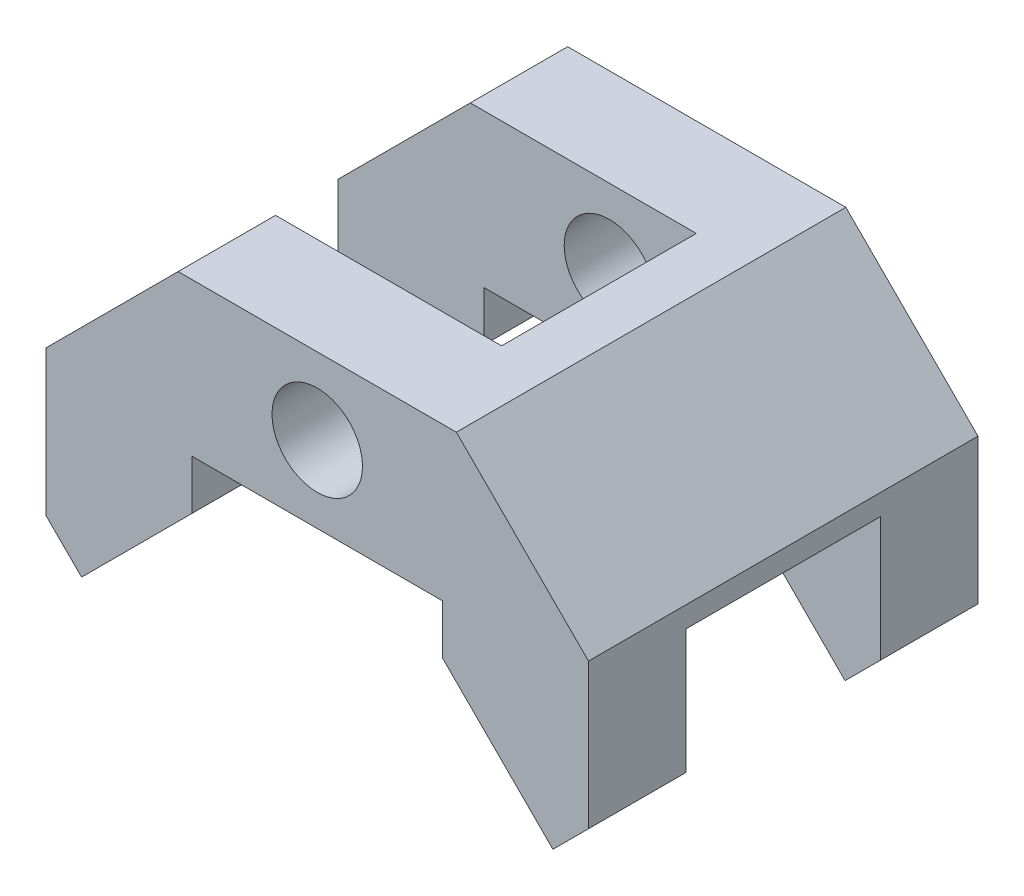
ISO-10303-21;
HEADER;
FILE_DESCRIPTION(('STEP AP214'),'2;1');
FILE_NAME('part.step','',(''),(''),'','','');
FILE_SCHEMA(('AUTOMOTIVE_DESIGN { 1 0 10303 214 1 1 1 1 }'));
ENDSEC;
DATA;
#1=APPLICATION_CONTEXT('core data for automotive mechanical design processes');
#2=APPLICATION_PROTOCOL_DEFINITION('international standard','automotive_design',2000,#1);
#3=PRODUCT_CONTEXT('',#1,'mechanical');
#4=PRODUCT('Part','Part','',(#3));
#5=PRODUCT_RELATED_PRODUCT_CATEGORY('part','',(#4));
#6=PRODUCT_DEFINITION_FORMATION('','',#4);
#7=PRODUCT_DEFINITION_CONTEXT('part definition',#1,'design');
#8=PRODUCT_DEFINITION('design','',#6,#7);
#9=PRODUCT_DEFINITION_SHAPE('','',#8);
#10=(LENGTH_UNIT() NAMED_UNIT(*) SI_UNIT(.MILLI.,.METRE.));
#11=(NAMED_UNIT(*) PLANE_ANGLE_UNIT() SI_UNIT($,.RADIAN.));
#12=(NAMED_UNIT(*) SI_UNIT($,.STERADIAN.) SOLID_ANGLE_UNIT());
#13=UNCERTAINTY_MEASURE_WITH_UNIT(LENGTH_MEASURE(1.E-05),#10,'distance_accuracy_value','');
#14=(GEOMETRIC_REPRESENTATION_CONTEXT(3) GLOBAL_UNCERTAINTY_ASSIGNED_CONTEXT((#13)) GLOBAL_UNIT_ASSIGNED_CONTEXT((#10,
#11,#12)) REPRESENTATION_CONTEXT('',''));
#15=CARTESIAN_POINT('',(0.,0.,0.));
#16=DIRECTION('',(0.,0.,1.));
#17=DIRECTION('',(1.,0.,0.));
#18=AXIS2_PLACEMENT_3D('',#15,#16,#17);
#19=CARTESIAN_POINT('',(18.,-29.1126983722081,28.));
#20=DIRECTION('',(0.707106781186548,0.707106781186547,0.));
#21=DIRECTION('',(-0.707106781186547,0.707106781186548,0.));
#22=AXIS2_PLACEMENT_3D('',#19,#20,#21);
#23=PLANE('',#22);
#24=DIRECTION('',(0.707106781186547,-0.707106781186548,0.));
#25=VECTOR('',#24,1.);
#26=CARTESIAN_POINT('',(18.,-29.1126983722081,14.));
#27=LINE('',#26,#25);
#28=CARTESIAN_POINT('',(18.,-29.1126983722081,14.));
#29=VERTEX_POINT('',#28);
#30=CARTESIAN_POINT('',(33.8847763108502,-44.9974746830584,14.));
#31=VERTEX_POINT('',#30);
#32=EDGE_CURVE('E210',#29,#31,#27,.T.);
#33=ORIENTED_EDGE('',*,*,#32,.T.);
#34=DIRECTION('',(0.,0.,1.));
#35=VECTOR('',#34,1.);
#36=CARTESIAN_POINT('',(33.8847763108502,-44.9974746830584,28.));
#37=LINE('',#36,#35);
#38=CARTESIAN_POINT('',(33.8847763108502,-44.9974746830584,28.));
#39=VERTEX_POINT('',#38);
#40=EDGE_CURVE('E497',#31,#39,#37,.T.);
#41=ORIENTED_EDGE('',*,*,#40,.T.);
#42=DIRECTION('',(0.707106781186547,-0.707106781186548,0.));
#43=VECTOR('',#42,1.);
#44=CARTESIAN_POINT('',(18.,-29.1126983722081,28.));
#45=LINE('',#44,#43);
#46=CARTESIAN_POINT('',(18.,-29.1126983722081,28.));
#47=VERTEX_POINT('',#46);
#48=EDGE_CURVE('E214',#47,#39,#45,.T.);
#49=ORIENTED_EDGE('',*,*,#48,.F.);
#50=DIRECTION('',(0.,0.,-1.));
#51=VECTOR('',#50,1.);
#52=CARTESIAN_POINT('',(18.,-29.1126983722081,28.));
#53=LINE('',#52,#51);
#54=EDGE_CURVE('E213',#47,#29,#53,.T.);
#55=ORIENTED_EDGE('',*,*,#54,.T.);
#56=EDGE_LOOP('',(#33,#41,#49,#55));
#57=FACE_BOUND('',#56,.T.);
#58=ADVANCED_FACE('F44',(#57),#23,.F.);
#59=CARTESIAN_POINT('',(-39.,-19.0000000000001,28.));
#60=DIRECTION('',(1.,0.,0.));
#61=DIRECTION('',(0.,0.,-1.));
#62=AXIS2_PLACEMENT_3D('',#59,#60,#61);
#63=PLANE('',#62);
#64=DIRECTION('',(0.,1.,0.));
#65=VECTOR('',#64,1.);
#66=CARTESIAN_POINT('',(-39.,-44.9974746830584,14.));
#67=LINE('',#66,#65);
#68=CARTESIAN_POINT('',(-39.,-19.0000000000001,14.));
#69=VERTEX_POINT('',#68);
#70=CARTESIAN_POINT('',(-39.,-39.8822509939086,14.));
#71=VERTEX_POINT('',#70);
#72=EDGE_CURVE('E465',#69,#71,#67,.F.);
#73=ORIENTED_EDGE('',*,*,#72,.T.);
#74=DIRECTION('',(0.,0.,1.));
#75=VECTOR('',#74,1.);
#76=CARTESIAN_POINT('',(-39.,-39.8822509939086,28.));
#77=LINE('',#76,#75);
#78=CARTESIAN_POINT('',(-39.,-39.8822509939086,28.));
#79=VERTEX_POINT('',#78);
#80=EDGE_CURVE('E247',#71,#79,#77,.T.);
#81=ORIENTED_EDGE('',*,*,#80,.T.);
#82=DIRECTION('',(0.,1.,0.));
#83=VECTOR('',#82,1.);
#84=CARTESIAN_POINT('',(-39.,0.,28.));
#85=LINE('',#84,#83);
#86=CARTESIAN_POINT('',(-39.,-19.0000000000001,28.));
#87=VERTEX_POINT('',#86);
#88=EDGE_CURVE('E494',#87,#79,#85,.F.);
#89=ORIENTED_EDGE('',*,*,#88,.F.);
#90=DIRECTION('',(0.,0.,1.));
#91=VECTOR('',#90,1.);
#92=CARTESIAN_POINT('',(-39.,-19.0000000000001,28.));
#93=LINE('',#92,#91);
#94=EDGE_CURVE('E471',#87,#69,#93,.F.);
#95=ORIENTED_EDGE('',*,*,#94,.T.);
#96=EDGE_LOOP('',(#73,#81,#89,#95));
#97=FACE_BOUND('',#96,.T.);
#98=ADVANCED_FACE('F821',(#97),#63,.F.);
#99=CARTESIAN_POINT('',(-39.,-39.8822509939086,28.));
#100=DIRECTION('',(0.707106781186546,0.707106781186549,0.));
#101=DIRECTION('',(-0.707106781186549,0.707106781186546,0.));
#102=AXIS2_PLACEMENT_3D('',#99,#100,#101);
#103=PLANE('',#102);
#104=DIRECTION('',(0.707106781186549,-0.707106781186546,0.));
#105=VECTOR('',#104,1.);
#106=CARTESIAN_POINT('',(-39.,-39.8822509939086,14.));
#107=LINE('',#106,#105);
#108=CARTESIAN_POINT('',(-33.8847763108502,-44.9974746830584,14.));
#109=VERTEX_POINT('',#108);
#110=EDGE_CURVE('E461',#71,#109,#107,.T.);
#111=ORIENTED_EDGE('',*,*,#110,.T.);
#112=DIRECTION('',(0.,0.,1.));
#113=VECTOR('',#112,1.);
#114=CARTESIAN_POINT('',(-33.8847763108502,-44.9974746830584,28.));
#115=LINE('',#114,#113);
#116=CARTESIAN_POINT('',(-33.8847763108502,-44.9974746830584,28.));
#117=VERTEX_POINT('',#116);
#118=EDGE_CURVE('E244',#109,#117,#115,.T.);
#119=ORIENTED_EDGE('',*,*,#118,.T.);
#120=DIRECTION('',(0.707106781186549,-0.707106781186546,0.));
#121=VECTOR('',#120,1.);
#122=CARTESIAN_POINT('',(-39.,-39.8822509939086,28.));
#123=LINE('',#122,#121);
#124=EDGE_CURVE('E491',#79,#117,#123,.T.);
#125=ORIENTED_EDGE('',*,*,#124,.F.);
#126=ORIENTED_EDGE('',*,*,#80,.F.);
#127=EDGE_LOOP('',(#111,#119,#125,#126));
#128=FACE_BOUND('',#127,.T.);
#129=ADVANCED_FACE('F812',(#128),#103,.F.);
#130=CARTESIAN_POINT('',(-33.8847763108502,-44.9974746830584,28.));
#131=DIRECTION('',(-0.707106781186549,0.707106781186546,0.));
#132=DIRECTION('',(-0.707106781186546,-0.707106781186549,0.));
#133=AXIS2_PLACEMENT_3D('',#130,#131,#132);
#134=PLANE('',#133);
#135=DIRECTION('',(0.707106781186546,0.707106781186549,0.));
#136=VECTOR('',#135,1.);
#137=CARTESIAN_POINT('',(-33.8847763108502,-44.9974746830584,14.));
#138=LINE('',#137,#136);
#139=CARTESIAN_POINT('',(-18.,-29.1126983722081,14.));
#140=VERTEX_POINT('',#139);
#141=EDGE_CURVE('E457',#109,#140,#138,.T.);
#142=ORIENTED_EDGE('',*,*,#141,.T.);
#143=DIRECTION('',(0.,0.,1.));
#144=VECTOR('',#143,1.);
#145=CARTESIAN_POINT('',(-18.,-29.1126983722081,28.));
#146=LINE('',#145,#144);
#147=CARTESIAN_POINT('',(-18.,-29.1126983722081,28.));
#148=VERTEX_POINT('',#147);
#149=EDGE_CURVE('E220',#140,#148,#146,.T.);
#150=ORIENTED_EDGE('',*,*,#149,.T.);
#151=DIRECTION('',(0.707106781186546,0.707106781186549,0.));
#152=VECTOR('',#151,1.);
#153=CARTESIAN_POINT('',(-33.8847763108502,-44.9974746830584,28.));
#154=LINE('',#153,#152);
#155=EDGE_CURVE('E488',#117,#148,#154,.T.);
#156=ORIENTED_EDGE('',*,*,#155,.F.);
#157=ORIENTED_EDGE('',*,*,#118,.F.);
#158=EDGE_LOOP('',(#142,#150,#156,#157));
#159=FACE_BOUND('',#158,.T.);
#160=ADVANCED_FACE('F803',(#159),#134,.F.);
#161=CARTESIAN_POINT('',(-18.,-29.1126983722081,28.));
#162=DIRECTION('',(-1.,0.,0.));
#163=DIRECTION('',(0.,-1.,0.));
#164=AXIS2_PLACEMENT_3D('',#161,#162,#163);
#165=PLANE('',#164);
#166=DIRECTION('',(0.,1.,0.));
#167=VECTOR('',#166,1.);
#168=CARTESIAN_POINT('',(-18.,-44.9974746830584,14.));
#169=LINE('',#168,#167);
#170=CARTESIAN_POINT('',(-18.,-22.,14.));
#171=VERTEX_POINT('',#170);
#172=EDGE_CURVE('E453',#140,#171,#169,.T.);
#173=ORIENTED_EDGE('',*,*,#172,.T.);
#174=DIRECTION('',(0.,0.,1.));
#175=VECTOR('',#174,1.);
#176=CARTESIAN_POINT('',(-18.,-22.,28.));
#177=LINE('',#176,#175);
#178=CARTESIAN_POINT('',(-18.,-22.,28.));
#179=VERTEX_POINT('',#178);
#180=EDGE_CURVE('E413',#171,#179,#177,.T.);
#181=ORIENTED_EDGE('',*,*,#180,.T.);
#182=DIRECTION('',(0.,1.,0.));
#183=VECTOR('',#182,1.);
#184=CARTESIAN_POINT('',(-18.,0.,28.));
#185=LINE('',#184,#183);
#186=EDGE_CURVE('E485',#148,#179,#185,.T.);
#187=ORIENTED_EDGE('',*,*,#186,.F.);
#188=ORIENTED_EDGE('',*,*,#149,.F.);
#189=EDGE_LOOP('',(#173,#181,#187,#188));
#190=FACE_BOUND('',#189,.T.);
#191=ADVANCED_FACE('F795',(#190),#165,.F.);
#192=CARTESIAN_POINT('',(18.,-22.,28.));
#193=DIRECTION('',(1.,0.,0.));
#194=DIRECTION('',(0.,0.,-1.));
#195=AXIS2_PLACEMENT_3D('',#192,#193,#194);
#196=PLANE('',#195);
#197=DIRECTION('',(0.,1.,0.));
#198=VECTOR('',#197,1.);
#199=CARTESIAN_POINT('',(18.,-22.,14.));
#200=LINE('',#199,#198);
#201=CARTESIAN_POINT('',(18.,-22.,14.));
#202=VERTEX_POINT('',#201);
#203=EDGE_CURVE('E219',#202,#29,#200,.F.);
#204=ORIENTED_EDGE('',*,*,#203,.T.);
#205=ORIENTED_EDGE('',*,*,#54,.F.);
#206=DIRECTION('',(0.,1.,0.));
#207=VECTOR('',#206,1.);
#208=CARTESIAN_POINT('',(18.,0.,28.));
#209=LINE('',#208,#207);
#210=CARTESIAN_POINT('',(18.,-22.,28.));
#211=VERTEX_POINT('',#210);
#212=EDGE_CURVE('E483',#211,#47,#209,.F.);
#213=ORIENTED_EDGE('',*,*,#212,.F.);
#214=DIRECTION('',(0.,0.,1.));
#215=VECTOR('',#214,1.);
#216=CARTESIAN_POINT('',(18.,-22.,28.));
#217=LINE('',#216,#215);
#218=EDGE_CURVE('E234',#211,#202,#217,.F.);
#219=ORIENTED_EDGE('',*,*,#218,.T.);
#220=EDGE_LOOP('',(#204,#205,#213,#219));
#221=FACE_BOUND('',#220,.T.);
#222=ADVANCED_FACE('F232',(#221),#196,.F.);
#223=CARTESIAN_POINT('',(39.,-22.,14.));
#224=DIRECTION('',(0.,0.,1.));
#225=DIRECTION('',(1.,0.,0.));
#226=AXIS2_PLACEMENT_3D('',#223,#224,#225);
#227=PLANE('',#226);
#228=DIRECTION('',(0.,-1.,0.));
#229=VECTOR('',#228,1.);
#230=CARTESIAN_POINT('',(39.,-39.8822509939086,14.));
#231=LINE('',#230,#229);
#232=CARTESIAN_POINT('',(39.,-22.,14.));
#233=VERTEX_POINT('',#232);
#234=CARTESIAN_POINT('',(39.,-39.8822509939086,14.));
#235=VERTEX_POINT('',#234);
#236=EDGE_CURVE('E363',#233,#235,#231,.T.);
#237=ORIENTED_EDGE('',*,*,#236,.T.);
#238=DIRECTION('',(-0.707106781186548,-0.707106781186547,0.));
#239=VECTOR('',#238,1.);
#240=CARTESIAN_POINT('',(33.8847763108502,-44.9974746830584,14.));
#241=LINE('',#240,#239);
#242=EDGE_CURVE('E228',#235,#31,#241,.T.);
#243=ORIENTED_EDGE('',*,*,#242,.T.);
#244=ORIENTED_EDGE('',*,*,#32,.F.);
#245=ORIENTED_EDGE('',*,*,#203,.F.);
#246=DIRECTION('',(1.,0.,0.));
#247=VECTOR('',#246,1.);
#248=CARTESIAN_POINT('',(-18.,-22.,14.));
#249=LINE('',#248,#247);
#250=EDGE_CURVE('E405',#202,#233,#249,.T.);
#251=ORIENTED_EDGE('',*,*,#250,.T.);
#252=EDGE_LOOP('',(#237,#243,#244,#245,#251));
#253=FACE_BOUND('',#252,.T.);
#254=ADVANCED_FACE('F225',(#253),#227,.F.);
#255=CARTESIAN_POINT('',(33.8847763108502,-44.9974746830584,28.));
#256=DIRECTION('',(-0.707106781186547,0.707106781186548,0.));
#257=DIRECTION('',(-0.707106781186548,-0.707106781186547,0.));
#258=AXIS2_PLACEMENT_3D('',#255,#256,#257);
#259=PLANE('',#258);
#260=ORIENTED_EDGE('',*,*,#242,.F.);
#261=DIRECTION('',(0.,0.,1.));
#262=VECTOR('',#261,1.);
#263=CARTESIAN_POINT('',(39.,-39.8822509939086,28.));
#264=LINE('',#263,#262);
#265=CARTESIAN_POINT('',(39.,-39.8822509939086,28.));
#266=VERTEX_POINT('',#265);
#267=EDGE_CURVE('E359',#235,#266,#264,.T.);
#268=ORIENTED_EDGE('',*,*,#267,.T.);
#269=DIRECTION('',(0.707106781186549,0.707106781186547,0.));
#270=VECTOR('',#269,1.);
#271=CARTESIAN_POINT('',(33.8847763108502,-44.9974746830584,28.));
#272=LINE('',#271,#270);
#273=EDGE_CURVE('E478',#39,#266,#272,.T.);
#274=ORIENTED_EDGE('',*,*,#273,.F.);
#275=ORIENTED_EDGE('',*,*,#40,.F.);
#276=EDGE_LOOP('',(#260,#268,#274,#275));
#277=FACE_BOUND('',#276,.T.);
#278=ADVANCED_FACE('F589',(#277),#259,.F.);
#279=CARTESIAN_POINT('',(39.,-45.2358172252474,-14.));
#280=DIRECTION('',(0.,0.,-1.));
#281=DIRECTION('',(-1.,0.,0.));
#282=AXIS2_PLACEMENT_3D('',#279,#280,#281);
#283=PLANE('',#282);
#284=DIRECTION('',(-0.707106781186548,-0.707106781186547,0.));
#285=VECTOR('',#284,1.);
#286=CARTESIAN_POINT('',(33.8847763108502,-44.9974746830584,-14.));
#287=LINE('',#286,#285);
#288=CARTESIAN_POINT('',(33.8847763108502,-44.9974746830584,-14.));
#289=VERTEX_POINT('',#288);
#290=CARTESIAN_POINT('',(39.,-39.8822509939086,-14.));
#291=VERTEX_POINT('',#290);
#292=EDGE_CURVE('E366',#289,#291,#287,.F.);
#293=ORIENTED_EDGE('',*,*,#292,.T.);
#294=DIRECTION('',(0.,-1.,0.));
#295=VECTOR('',#294,1.);
#296=CARTESIAN_POINT('',(39.,-39.8822509939086,-14.));
#297=LINE('',#296,#295);
#298=CARTESIAN_POINT('',(39.,-22.,-14.));
#299=VERTEX_POINT('',#298);
#300=EDGE_CURVE('E348',#291,#299,#297,.F.);
#301=ORIENTED_EDGE('',*,*,#300,.T.);
#302=DIRECTION('',(1.,0.,0.));
#303=VECTOR('',#302,1.);
#304=CARTESIAN_POINT('',(-18.,-22.,-14.));
#305=LINE('',#304,#303);
#306=CARTESIAN_POINT('',(18.,-22.,-14.));
#307=VERTEX_POINT('',#306);
#308=EDGE_CURVE('E402',#299,#307,#305,.F.);
#309=ORIENTED_EDGE('',*,*,#308,.T.);
#310=DIRECTION('',(0.,1.,0.));
#311=VECTOR('',#310,1.);
#312=CARTESIAN_POINT('',(18.,-22.,-14.));
#313=LINE('',#312,#311);
#314=CARTESIAN_POINT('',(18.,-29.1126983722081,-14.));
#315=VERTEX_POINT('',#314);
#316=EDGE_CURVE('E380',#307,#315,#313,.F.);
#317=ORIENTED_EDGE('',*,*,#316,.T.);
#318=DIRECTION('',(-0.707106781186547,0.707106781186548,0.));
#319=VECTOR('',#318,1.);
#320=CARTESIAN_POINT('',(18.,-29.1126983722081,-14.));
#321=LINE('',#320,#319);
#322=EDGE_CURVE('E373',#315,#289,#321,.F.);
#323=ORIENTED_EDGE('',*,*,#322,.T.);
#324=EDGE_LOOP('',(#293,#301,#309,#317,#323));
#325=FACE_BOUND('',#324,.T.);
#326=ADVANCED_FACE('F591',(#325),#283,.F.);
#327=CARTESIAN_POINT('',(0.,0.,28.));
#328=DIRECTION('',(0.,0.,1.));
#329=DIRECTION('',(1.,0.,0.));
#330=AXIS2_PLACEMENT_3D('',#327,#328,#329);
#331=PLANE('',#330);
#332=CARTESIAN_POINT('',(-1.07188563580607E-13,-10.9999999999999,28.));
#333=DIRECTION('',(0.,0.,1.));
#334=DIRECTION('',(1.,0.,0.));
#335=AXIS2_PLACEMENT_3D('',#332,#333,#334);
#336=CIRCLE('',#335,6.5);
#337=CARTESIAN_POINT('',(6.49999999999989,-10.9999999999999,28.));
#338=VERTEX_POINT('',#337);
#339=EDGE_CURVE('E501',#338,#338,#336,.T.);
#340=ORIENTED_EDGE('',*,*,#339,.F.);
#341=EDGE_LOOP('',(#340));
#342=FACE_BOUND('',#341,.T.);
#343=DIRECTION('',(0.,-1.,0.));
#344=VECTOR('',#343,1.);
#345=CARTESIAN_POINT('',(39.,-39.8822509939086,28.));
#346=LINE('',#345,#344);
#347=CARTESIAN_POINT('',(39.,-19.0000000000001,28.));
#348=VERTEX_POINT('',#347);
#349=EDGE_CURVE('E356',#266,#348,#346,.F.);
#350=ORIENTED_EDGE('',*,*,#349,.T.);
#351=DIRECTION('',(0.707106781186547,-0.707106781186548,0.));
#352=VECTOR('',#351,1.);
#353=CARTESIAN_POINT('',(39.,-19.0000000000001,28.));
#354=LINE('',#353,#352);
#355=CARTESIAN_POINT('',(20.,0.,28.));
#356=VERTEX_POINT('',#355);
#357=EDGE_CURVE('E338',#348,#356,#354,.F.);
#358=ORIENTED_EDGE('',*,*,#357,.T.);
#359=DIRECTION('',(1.,0.,0.));
#360=VECTOR('',#359,1.);
#361=CARTESIAN_POINT('',(0.,0.,28.));
#362=LINE('',#361,#360);
#363=CARTESIAN_POINT('',(-20.,0.,28.));
#364=VERTEX_POINT('',#363);
#365=EDGE_CURVE('E332',#356,#364,#362,.F.);
#366=ORIENTED_EDGE('',*,*,#365,.T.);
#367=DIRECTION('',(0.707106781186546,0.707106781186549,0.));
#368=VECTOR('',#367,1.);
#369=CARTESIAN_POINT('',(-20.,0.,28.));
#370=LINE('',#369,#368);
#371=EDGE_CURVE('E474',#364,#87,#370,.F.);
#372=ORIENTED_EDGE('',*,*,#371,.T.);
#373=ORIENTED_EDGE('',*,*,#88,.T.);
#374=ORIENTED_EDGE('',*,*,#124,.T.);
#375=ORIENTED_EDGE('',*,*,#155,.T.);
#376=ORIENTED_EDGE('',*,*,#186,.T.);
#377=DIRECTION('',(1.,0.,0.));
#378=VECTOR('',#377,1.);
#379=CARTESIAN_POINT('',(-18.,-22.,28.));
#380=LINE('',#379,#378);
#381=EDGE_CURVE('E409',#179,#211,#380,.T.);
#382=ORIENTED_EDGE('',*,*,#381,.T.);
#383=ORIENTED_EDGE('',*,*,#212,.T.);
#384=ORIENTED_EDGE('',*,*,#48,.T.);
#385=ORIENTED_EDGE('',*,*,#273,.T.);
#386=EDGE_LOOP('',(#350,#358,#366,#372,#373,#374,#375,#376,#382,#383,#384,#385));
#387=FACE_BOUND('',#386,.T.);
#388=ADVANCED_FACE('F586',(#342,#387),#331,.T.);
#389=CARTESIAN_POINT('',(-20.,0.,28.));
#390=DIRECTION('',(0.707106781186549,-0.707106781186546,0.));
#391=DIRECTION('',(0.707106781186546,0.707106781186549,0.));
#392=AXIS2_PLACEMENT_3D('',#389,#390,#391);
#393=PLANE('',#392);
#394=DIRECTION('',(-0.707106781186545,-0.70710678118655,0.));
#395=VECTOR('',#394,1.);
#396=CARTESIAN_POINT('',(-20.,0.,14.));
#397=LINE('',#396,#395);
#398=CARTESIAN_POINT('',(-20.,0.,14.));
#399=VERTEX_POINT('',#398);
#400=EDGE_CURVE('E467',#399,#69,#397,.T.);
#401=ORIENTED_EDGE('',*,*,#400,.T.);
#402=ORIENTED_EDGE('',*,*,#94,.F.);
#403=ORIENTED_EDGE('',*,*,#371,.F.);
#404=DIRECTION('',(0.,0.,1.));
#405=VECTOR('',#404,1.);
#406=CARTESIAN_POINT('',(-20.,0.,28.));
#407=LINE('',#406,#405);
#408=EDGE_CURVE('E328',#364,#399,#407,.F.);
#409=ORIENTED_EDGE('',*,*,#408,.T.);
#410=EDGE_LOOP('',(#401,#402,#403,#409));
#411=FACE_BOUND('',#410,.T.);
#412=ADVANCED_FACE('F584',(#411),#393,.F.);
#413=CARTESIAN_POINT('',(-39.,-44.9974746830584,14.));
#414=DIRECTION('',(0.,0.,1.));
#415=DIRECTION('',(1.,0.,0.));
#416=AXIS2_PLACEMENT_3D('',#413,#414,#415);
#417=PLANE('',#416);
#418=CARTESIAN_POINT('',(-1.07188563580607E-13,-10.9999999999999,14.));
#419=DIRECTION('',(0.,0.,1.));
#420=DIRECTION('',(1.,0.,0.));
#421=AXIS2_PLACEMENT_3D('',#418,#419,#420);
#422=CIRCLE('',#421,6.5);
#423=CARTESIAN_POINT('',(6.49999999999989,-10.9999999999999,14.));
#424=VERTEX_POINT('',#423);
#425=EDGE_CURVE('E250',#424,#424,#422,.T.);
#426=ORIENTED_EDGE('',*,*,#425,.T.);
#427=EDGE_LOOP('',(#426));
#428=FACE_BOUND('',#427,.T.);
#429=DIRECTION('',(0.,1.,0.));
#430=VECTOR('',#429,1.);
#431=CARTESIAN_POINT('',(12.5,-44.9974746830584,14.));
#432=LINE('',#431,#430);
#433=CARTESIAN_POINT('',(12.5,0.,14.));
#434=VERTEX_POINT('',#433);
#435=CARTESIAN_POINT('',(12.5,-22.,14.));
#436=VERTEX_POINT('',#435);
#437=EDGE_CURVE('E450',#434,#436,#432,.F.);
#438=ORIENTED_EDGE('',*,*,#437,.T.);
#439=DIRECTION('',(1.,0.,0.));
#440=VECTOR('',#439,1.);
#441=CARTESIAN_POINT('',(-18.,-22.,14.));
#442=LINE('',#441,#440);
#443=EDGE_CURVE('E386',#436,#171,#442,.F.);
#444=ORIENTED_EDGE('',*,*,#443,.T.);
#445=ORIENTED_EDGE('',*,*,#172,.F.);
#446=ORIENTED_EDGE('',*,*,#141,.F.);
#447=ORIENTED_EDGE('',*,*,#110,.F.);
#448=ORIENTED_EDGE('',*,*,#72,.F.);
#449=ORIENTED_EDGE('',*,*,#400,.F.);
#450=DIRECTION('',(1.,0.,0.));
#451=VECTOR('',#450,1.);
#452=CARTESIAN_POINT('',(0.,0.,14.));
#453=LINE('',#452,#451);
#454=EDGE_CURVE('E324',#399,#434,#453,.T.);
#455=ORIENTED_EDGE('',*,*,#454,.T.);
#456=EDGE_LOOP('',(#438,#444,#445,#446,#447,#448,#449,#455));
#457=FACE_BOUND('',#456,.T.);
#458=ADVANCED_FACE('F579',(#428,#457),#417,.F.);
#459=CARTESIAN_POINT('',(12.5,-44.9974746830584,-14.));
#460=DIRECTION('',(1.,0.,0.));
#461=DIRECTION('',(0.,0.,-1.));
#462=AXIS2_PLACEMENT_3D('',#459,#460,#461);
#463=PLANE('',#462);
#464=DIRECTION('',(0.,0.,1.));
#465=VECTOR('',#464,1.);
#466=CARTESIAN_POINT('',(12.5,0.,28.));
#467=LINE('',#466,#465);
#468=CARTESIAN_POINT('',(12.5,0.,-14.));
#469=VERTEX_POINT('',#468);
#470=EDGE_CURVE('E320',#434,#469,#467,.F.);
#471=ORIENTED_EDGE('',*,*,#470,.T.);
#472=DIRECTION('',(0.,1.,0.));
#473=VECTOR('',#472,1.);
#474=CARTESIAN_POINT('',(12.5,-44.9974746830584,-14.));
#475=LINE('',#474,#473);
#476=CARTESIAN_POINT('',(12.5,-22.,-14.));
#477=VERTEX_POINT('',#476);
#478=EDGE_CURVE('E447',#469,#477,#475,.F.);
#479=ORIENTED_EDGE('',*,*,#478,.T.);
#480=DIRECTION('',(0.,0.,1.));
#481=VECTOR('',#480,1.);
#482=CARTESIAN_POINT('',(12.5,-22.,28.));
#483=LINE('',#482,#481);
#484=EDGE_CURVE('E390',#477,#436,#483,.T.);
#485=ORIENTED_EDGE('',*,*,#484,.T.);
#486=ORIENTED_EDGE('',*,*,#437,.F.);
#487=EDGE_LOOP('',(#471,#479,#485,#486));
#488=FACE_BOUND('',#487,.T.);
#489=ADVANCED_FACE('F523',(#488),#463,.F.);
#490=CARTESIAN_POINT('',(-39.,-44.9974746830584,-14.));
#491=DIRECTION('',(0.,0.,-1.));
#492=DIRECTION('',(-1.,0.,0.));
#493=AXIS2_PLACEMENT_3D('',#490,#491,#492);
#494=PLANE('',#493);
#495=CARTESIAN_POINT('',(-1.07188563580607E-13,-10.9999999999999,-14.));
#496=DIRECTION('',(0.,0.,-1.));
#497=DIRECTION('',(-1.,0.,0.));
#498=AXIS2_PLACEMENT_3D('',#495,#496,#497);
#499=CIRCLE('',#498,6.5);
#500=CARTESIAN_POINT('',(-6.50000000000011,-10.9999999999999,-14.));
#501=VERTEX_POINT('',#500);
#502=EDGE_CURVE('E258',#501,#501,#499,.T.);
#503=ORIENTED_EDGE('',*,*,#502,.T.);
#504=EDGE_LOOP('',(#503));
#505=FACE_BOUND('',#504,.T.);
#506=DIRECTION('',(-0.707106781186549,0.707106781186546,0.));
#507=VECTOR('',#506,1.);
#508=CARTESIAN_POINT('',(-39.,-39.8822509939086,-14.));
#509=LINE('',#508,#507);
#510=CARTESIAN_POINT('',(-39.,-39.8822509939086,-14.));
#511=VERTEX_POINT('',#510);
#512=CARTESIAN_POINT('',(-33.8847763108502,-44.9974746830584,-14.));
#513=VERTEX_POINT('',#512);
#514=EDGE_CURVE('E431',#511,#513,#509,.F.);
#515=ORIENTED_EDGE('',*,*,#514,.T.);
#516=DIRECTION('',(-0.707106781186546,-0.707106781186549,0.));
#517=VECTOR('',#516,1.);
#518=CARTESIAN_POINT('',(-33.8847763108502,-44.9974746830584,-14.));
#519=LINE('',#518,#517);
#520=CARTESIAN_POINT('',(-18.,-29.1126983722081,-14.));
#521=VERTEX_POINT('',#520);
#522=EDGE_CURVE('E424',#513,#521,#519,.F.);
#523=ORIENTED_EDGE('',*,*,#522,.T.);
#524=DIRECTION('',(0.,-1.,0.));
#525=VECTOR('',#524,1.);
#526=CARTESIAN_POINT('',(-18.,-29.1126983722081,-14.));
#527=LINE('',#526,#525);
#528=CARTESIAN_POINT('',(-18.,-22.,-14.));
#529=VERTEX_POINT('',#528);
#530=EDGE_CURVE('E417',#521,#529,#527,.F.);
#531=ORIENTED_EDGE('',*,*,#530,.T.);
#532=DIRECTION('',(1.,0.,0.));
#533=VECTOR('',#532,1.);
#534=CARTESIAN_POINT('',(-18.,-22.,-14.));
#535=LINE('',#534,#533);
#536=EDGE_CURVE('E394',#529,#477,#535,.T.);
#537=ORIENTED_EDGE('',*,*,#536,.T.);
#538=ORIENTED_EDGE('',*,*,#478,.F.);
#539=DIRECTION('',(1.,0.,0.));
#540=VECTOR('',#539,1.);
#541=CARTESIAN_POINT('',(0.,0.,-14.));
#542=LINE('',#541,#540);
#543=CARTESIAN_POINT('',(-20.,0.,-14.));
#544=VERTEX_POINT('',#543);
#545=EDGE_CURVE('E316',#469,#544,#542,.F.);
#546=ORIENTED_EDGE('',*,*,#545,.T.);
#547=DIRECTION('',(0.707106781186546,0.707106781186549,0.));
#548=VECTOR('',#547,1.);
#549=CARTESIAN_POINT('',(-20.,0.,-14.));
#550=LINE('',#549,#548);
#551=CARTESIAN_POINT('',(-39.,-19.0000000000001,-14.));
#552=VERTEX_POINT('',#551);
#553=EDGE_CURVE('E444',#544,#552,#550,.F.);
#554=ORIENTED_EDGE('',*,*,#553,.T.);
#555=DIRECTION('',(0.,1.,0.));
#556=VECTOR('',#555,1.);
#557=CARTESIAN_POINT('',(-39.,-19.0000000000001,-14.));
#558=LINE('',#557,#556);
#559=EDGE_CURVE('E438',#552,#511,#558,.F.);
#560=ORIENTED_EDGE('',*,*,#559,.T.);
#561=EDGE_LOOP('',(#515,#523,#531,#537,#538,#546,#554,#560));
#562=FACE_BOUND('',#561,.T.);
#563=ADVANCED_FACE('F519',(#505,#562),#494,.F.);
#564=CARTESIAN_POINT('',(-20.,0.,28.));
#565=DIRECTION('',(0.707106781186549,-0.707106781186546,0.));
#566=DIRECTION('',(0.707106781186546,0.707106781186549,0.));
#567=AXIS2_PLACEMENT_3D('',#564,#565,#566);
#568=PLANE('',#567);
#569=ORIENTED_EDGE('',*,*,#553,.F.);
#570=DIRECTION('',(0.,0.,1.));
#571=VECTOR('',#570,1.);
#572=CARTESIAN_POINT('',(-20.,0.,28.));
#573=LINE('',#572,#571);
#574=CARTESIAN_POINT('',(-20.,0.,-28.));
#575=VERTEX_POINT('',#574);
#576=EDGE_CURVE('E312',#544,#575,#573,.F.);
#577=ORIENTED_EDGE('',*,*,#576,.T.);
#578=DIRECTION('',(-0.707106781186546,-0.707106781186549,0.));
#579=VECTOR('',#578,1.);
#580=CARTESIAN_POINT('',(-20.,0.,-28.));
#581=LINE('',#580,#579);
#582=CARTESIAN_POINT('',(-39.,-19.0000000000001,-28.));
#583=VERTEX_POINT('',#582);
#584=EDGE_CURVE('E308',#575,#583,#581,.T.);
#585=ORIENTED_EDGE('',*,*,#584,.T.);
#586=DIRECTION('',(0.,0.,-1.));
#587=VECTOR('',#586,1.);
#588=CARTESIAN_POINT('',(-39.,-19.0000000000001,28.));
#589=LINE('',#588,#587);
#590=EDGE_CURVE('E440',#583,#552,#589,.F.);
#591=ORIENTED_EDGE('',*,*,#590,.T.);
#592=EDGE_LOOP('',(#569,#577,#585,#591));
#593=FACE_BOUND('',#592,.T.);
#594=ADVANCED_FACE('F522',(#593),#568,.F.);
#595=CARTESIAN_POINT('',(-39.,-19.0000000000001,28.));
#596=DIRECTION('',(1.,0.,0.));
#597=DIRECTION('',(0.,0.,-1.));
#598=AXIS2_PLACEMENT_3D('',#595,#596,#597);
#599=PLANE('',#598);
#600=ORIENTED_EDGE('',*,*,#559,.F.);
#601=ORIENTED_EDGE('',*,*,#590,.F.);
#602=DIRECTION('',(0.,1.,0.));
#603=VECTOR('',#602,1.);
#604=CARTESIAN_POINT('',(-39.,0.,-28.));
#605=LINE('',#604,#603);
#606=CARTESIAN_POINT('',(-39.,-39.8822509939086,-28.));
#607=VERTEX_POINT('',#606);
#608=EDGE_CURVE('E304',#583,#607,#605,.F.);
#609=ORIENTED_EDGE('',*,*,#608,.T.);
#610=DIRECTION('',(0.,0.,1.));
#611=VECTOR('',#610,1.);
#612=CARTESIAN_POINT('',(-39.,-39.8822509939086,28.));
#613=LINE('',#612,#611);
#614=EDGE_CURVE('E434',#607,#511,#613,.T.);
#615=ORIENTED_EDGE('',*,*,#614,.T.);
#616=EDGE_LOOP('',(#600,#601,#609,#615));
#617=FACE_BOUND('',#616,.T.);
#618=ADVANCED_FACE('F539',(#617),#599,.F.);
#619=CARTESIAN_POINT('',(-39.,-39.8822509939086,28.));
#620=DIRECTION('',(0.707106781186546,0.707106781186549,0.));
#621=DIRECTION('',(-0.707106781186549,0.707106781186546,0.));
#622=AXIS2_PLACEMENT_3D('',#619,#620,#621);
#623=PLANE('',#622);
#624=ORIENTED_EDGE('',*,*,#514,.F.);
#625=ORIENTED_EDGE('',*,*,#614,.F.);
#626=DIRECTION('',(0.707106781186549,-0.707106781186546,0.));
#627=VECTOR('',#626,1.);
#628=CARTESIAN_POINT('',(-39.,-39.8822509939086,-28.));
#629=LINE('',#628,#627);
#630=CARTESIAN_POINT('',(-33.8847763108502,-44.9974746830584,-28.));
#631=VERTEX_POINT('',#630);
#632=EDGE_CURVE('E300',#607,#631,#629,.T.);
#633=ORIENTED_EDGE('',*,*,#632,.T.);
#634=DIRECTION('',(0.,0.,1.));
#635=VECTOR('',#634,1.);
#636=CARTESIAN_POINT('',(-33.8847763108502,-44.9974746830584,28.));
#637=LINE('',#636,#635);
#638=EDGE_CURVE('E427',#631,#513,#637,.T.);
#639=ORIENTED_EDGE('',*,*,#638,.T.);
#640=EDGE_LOOP('',(#624,#625,#633,#639));
#641=FACE_BOUND('',#640,.T.);
#642=ADVANCED_FACE('F533',(#641),#623,.F.);
#643=CARTESIAN_POINT('',(-33.8847763108502,-44.9974746830584,28.));
#644=DIRECTION('',(-0.707106781186549,0.707106781186546,0.));
#645=DIRECTION('',(-0.707106781186546,-0.707106781186549,0.));
#646=AXIS2_PLACEMENT_3D('',#643,#644,#645);
#647=PLANE('',#646);
#648=ORIENTED_EDGE('',*,*,#522,.F.);
#649=ORIENTED_EDGE('',*,*,#638,.F.);
#650=DIRECTION('',(0.707106781186546,0.707106781186549,0.));
#651=VECTOR('',#650,1.);
#652=CARTESIAN_POINT('',(-33.8847763108502,-44.9974746830584,-28.));
#653=LINE('',#652,#651);
#654=CARTESIAN_POINT('',(-18.,-29.1126983722081,-28.));
#655=VERTEX_POINT('',#654);
#656=EDGE_CURVE('E296',#631,#655,#653,.T.);
#657=ORIENTED_EDGE('',*,*,#656,.T.);
#658=DIRECTION('',(0.,0.,1.));
#659=VECTOR('',#658,1.);
#660=CARTESIAN_POINT('',(-18.,-29.1126983722081,28.));
#661=LINE('',#660,#659);
#662=EDGE_CURVE('E420',#655,#521,#661,.T.);
#663=ORIENTED_EDGE('',*,*,#662,.T.);
#664=EDGE_LOOP('',(#648,#649,#657,#663));
#665=FACE_BOUND('',#664,.T.);
#666=ADVANCED_FACE('F531',(#665),#647,.F.);
#667=CARTESIAN_POINT('',(-18.,-29.1126983722081,28.));
#668=DIRECTION('',(-1.,0.,0.));
#669=DIRECTION('',(0.,-1.,0.));
#670=AXIS2_PLACEMENT_3D('',#667,#668,#669);
#671=PLANE('',#670);
#672=ORIENTED_EDGE('',*,*,#530,.F.);
#673=ORIENTED_EDGE('',*,*,#662,.F.);
#674=DIRECTION('',(0.,1.,0.));
#675=VECTOR('',#674,1.);
#676=CARTESIAN_POINT('',(-18.,0.,-28.));
#677=LINE('',#676,#675);
#678=CARTESIAN_POINT('',(-18.,-22.,-28.));
#679=VERTEX_POINT('',#678);
#680=EDGE_CURVE('E292',#655,#679,#677,.T.);
#681=ORIENTED_EDGE('',*,*,#680,.T.);
#682=DIRECTION('',(0.,0.,1.));
#683=VECTOR('',#682,1.);
#684=CARTESIAN_POINT('',(-18.,-22.,28.));
#685=LINE('',#684,#683);
#686=EDGE_CURVE('E398',#679,#529,#685,.T.);
#687=ORIENTED_EDGE('',*,*,#686,.T.);
#688=EDGE_LOOP('',(#672,#673,#681,#687));
#689=FACE_BOUND('',#688,.T.);
#690=ADVANCED_FACE('F570',(#689),#671,.F.);
#691=CARTESIAN_POINT('',(-18.,-22.,28.));
#692=DIRECTION('',(0.,1.,0.));
#693=DIRECTION('',(0.,0.,1.));
#694=AXIS2_PLACEMENT_3D('',#691,#692,#693);
#695=PLANE('',#694);
#696=ORIENTED_EDGE('',*,*,#484,.F.);
#697=ORIENTED_EDGE('',*,*,#536,.F.);
#698=ORIENTED_EDGE('',*,*,#686,.F.);
#699=DIRECTION('',(1.,0.,0.));
#700=VECTOR('',#699,1.);
#701=CARTESIAN_POINT('',(0.,-22.,-28.));
#702=LINE('',#701,#700);
#703=CARTESIAN_POINT('',(18.,-22.,-28.));
#704=VERTEX_POINT('',#703);
#705=EDGE_CURVE('E288',#679,#704,#702,.T.);
#706=ORIENTED_EDGE('',*,*,#705,.T.);
#707=DIRECTION('',(0.,0.,-1.));
#708=VECTOR('',#707,1.);
#709=CARTESIAN_POINT('',(18.,-22.,28.));
#710=LINE('',#709,#708);
#711=EDGE_CURVE('E383',#704,#307,#710,.F.);
#712=ORIENTED_EDGE('',*,*,#711,.T.);
#713=ORIENTED_EDGE('',*,*,#308,.F.);
#714=DIRECTION('',(0.,0.,1.));
#715=VECTOR('',#714,1.);
#716=CARTESIAN_POINT('',(39.,-22.,28.));
#717=LINE('',#716,#715);
#718=EDGE_CURVE('E344',#299,#233,#717,.T.);
#719=ORIENTED_EDGE('',*,*,#718,.T.);
#720=ORIENTED_EDGE('',*,*,#250,.F.);
#721=ORIENTED_EDGE('',*,*,#218,.F.);
#722=ORIENTED_EDGE('',*,*,#381,.F.);
#723=ORIENTED_EDGE('',*,*,#180,.F.);
#724=ORIENTED_EDGE('',*,*,#443,.F.);
#725=EDGE_LOOP('',(#696,#697,#698,#706,#712,#713,#719,#720,#721,#722,#723,#724));
#726=FACE_BOUND('',#725,.T.);
#727=ADVANCED_FACE('F566',(#726),#695,.F.);
#728=CARTESIAN_POINT('',(18.,-22.,28.));
#729=DIRECTION('',(1.,0.,0.));
#730=DIRECTION('',(0.,0.,-1.));
#731=AXIS2_PLACEMENT_3D('',#728,#729,#730);
#732=PLANE('',#731);
#733=ORIENTED_EDGE('',*,*,#316,.F.);
#734=ORIENTED_EDGE('',*,*,#711,.F.);
#735=DIRECTION('',(0.,1.,0.));
#736=VECTOR('',#735,1.);
#737=CARTESIAN_POINT('',(18.,0.,-28.));
#738=LINE('',#737,#736);
#739=CARTESIAN_POINT('',(18.,-29.1126983722081,-28.));
#740=VERTEX_POINT('',#739);
#741=EDGE_CURVE('E284',#704,#740,#738,.F.);
#742=ORIENTED_EDGE('',*,*,#741,.T.);
#743=DIRECTION('',(0.,0.,1.));
#744=VECTOR('',#743,1.);
#745=CARTESIAN_POINT('',(18.,-29.1126983722081,28.));
#746=LINE('',#745,#744);
#747=EDGE_CURVE('E376',#740,#315,#746,.T.);
#748=ORIENTED_EDGE('',*,*,#747,.T.);
#749=EDGE_LOOP('',(#733,#734,#742,#748));
#750=FACE_BOUND('',#749,.T.);
#751=ADVANCED_FACE('F563',(#750),#732,.F.);
#752=CARTESIAN_POINT('',(18.,-29.1126983722081,28.));
#753=DIRECTION('',(0.707106781186548,0.707106781186547,0.));
#754=DIRECTION('',(-0.707106781186547,0.707106781186548,0.));
#755=AXIS2_PLACEMENT_3D('',#752,#753,#754);
#756=PLANE('',#755);
#757=ORIENTED_EDGE('',*,*,#322,.F.);
#758=ORIENTED_EDGE('',*,*,#747,.F.);
#759=DIRECTION('',(0.707106781186547,-0.707106781186548,0.));
#760=VECTOR('',#759,1.);
#761=CARTESIAN_POINT('',(18.,-29.1126983722081,-28.));
#762=LINE('',#761,#760);
#763=CARTESIAN_POINT('',(33.8847763108502,-44.9974746830584,-28.));
#764=VERTEX_POINT('',#763);
#765=EDGE_CURVE('E280',#740,#764,#762,.T.);
#766=ORIENTED_EDGE('',*,*,#765,.T.);
#767=DIRECTION('',(0.,0.,1.));
#768=VECTOR('',#767,1.);
#769=CARTESIAN_POINT('',(33.8847763108502,-44.9974746830584,28.));
#770=LINE('',#769,#768);
#771=EDGE_CURVE('E369',#764,#289,#770,.T.);
#772=ORIENTED_EDGE('',*,*,#771,.T.);
#773=EDGE_LOOP('',(#757,#758,#766,#772));
#774=FACE_BOUND('',#773,.T.);
#775=ADVANCED_FACE('F558',(#774),#756,.F.);
#776=CARTESIAN_POINT('',(33.8847763108502,-44.9974746830584,28.));
#777=DIRECTION('',(-0.707106781186547,0.707106781186548,0.));
#778=DIRECTION('',(-0.707106781186548,-0.707106781186547,0.));
#779=AXIS2_PLACEMENT_3D('',#776,#777,#778);
#780=PLANE('',#779);
#781=ORIENTED_EDGE('',*,*,#292,.F.);
#782=ORIENTED_EDGE('',*,*,#771,.F.);
#783=DIRECTION('',(0.707106781186549,0.707106781186547,0.));
#784=VECTOR('',#783,1.);
#785=CARTESIAN_POINT('',(33.8847763108502,-44.9974746830584,-28.));
#786=LINE('',#785,#784);
#787=CARTESIAN_POINT('',(39.,-39.8822509939086,-28.));
#788=VERTEX_POINT('',#787);
#789=EDGE_CURVE('E276',#764,#788,#786,.T.);
#790=ORIENTED_EDGE('',*,*,#789,.T.);
#791=DIRECTION('',(0.,0.,1.));
#792=VECTOR('',#791,1.);
#793=CARTESIAN_POINT('',(39.,-39.8822509939086,28.));
#794=LINE('',#793,#792);
#795=EDGE_CURVE('E352',#788,#291,#794,.T.);
#796=ORIENTED_EDGE('',*,*,#795,.T.);
#797=EDGE_LOOP('',(#781,#782,#790,#796));
#798=FACE_BOUND('',#797,.T.);
#799=ADVANCED_FACE('F555',(#798),#780,.F.);
#800=CARTESIAN_POINT('',(39.,-39.8822509939086,28.));
#801=DIRECTION('',(-1.,0.,0.));
#802=DIRECTION('',(0.,-1.,0.));
#803=AXIS2_PLACEMENT_3D('',#800,#801,#802);
#804=PLANE('',#803);
#805=ORIENTED_EDGE('',*,*,#300,.F.);
#806=ORIENTED_EDGE('',*,*,#795,.F.);
#807=DIRECTION('',(0.,1.,0.));
#808=VECTOR('',#807,1.);
#809=CARTESIAN_POINT('',(39.,0.,-28.));
#810=LINE('',#809,#808);
#811=CARTESIAN_POINT('',(39.,-19.0000000000001,-28.));
#812=VERTEX_POINT('',#811);
#813=EDGE_CURVE('E272',#788,#812,#810,.T.);
#814=ORIENTED_EDGE('',*,*,#813,.T.);
#815=DIRECTION('',(0.,0.,1.));
#816=VECTOR('',#815,1.);
#817=CARTESIAN_POINT('',(39.,-19.0000000000001,28.));
#818=LINE('',#817,#816);
#819=EDGE_CURVE('E341',#812,#348,#818,.T.);
#820=ORIENTED_EDGE('',*,*,#819,.T.);
#821=ORIENTED_EDGE('',*,*,#349,.F.);
#822=ORIENTED_EDGE('',*,*,#267,.F.);
#823=ORIENTED_EDGE('',*,*,#236,.F.);
#824=ORIENTED_EDGE('',*,*,#718,.F.);
#825=EDGE_LOOP('',(#805,#806,#814,#820,#821,#822,#823,#824));
#826=FACE_BOUND('',#825,.T.);
#827=ADVANCED_FACE('F549',(#826),#804,.F.);
#828=CARTESIAN_POINT('',(39.,-19.0000000000001,28.));
#829=DIRECTION('',(-0.707106781186548,-0.707106781186547,0.));
#830=DIRECTION('',(0.707106781186547,-0.707106781186548,0.));
#831=AXIS2_PLACEMENT_3D('',#828,#829,#830);
#832=PLANE('',#831);
#833=DIRECTION('',(0.,0.,1.));
#834=VECTOR('',#833,1.);
#835=CARTESIAN_POINT('',(20.,0.,28.));
#836=LINE('',#835,#834);
#837=CARTESIAN_POINT('',(20.,0.,-28.));
#838=VERTEX_POINT('',#837);
#839=EDGE_CURVE('E62',#838,#356,#836,.T.);
#840=ORIENTED_EDGE('',*,*,#839,.T.);
#841=ORIENTED_EDGE('',*,*,#357,.F.);
#842=ORIENTED_EDGE('',*,*,#819,.F.);
#843=DIRECTION('',(-0.707106781186547,0.707106781186548,0.));
#844=VECTOR('',#843,1.);
#845=CARTESIAN_POINT('',(39.,-19.0000000000001,-28.));
#846=LINE('',#845,#844);
#847=EDGE_CURVE('E54',#812,#838,#846,.T.);
#848=ORIENTED_EDGE('',*,*,#847,.T.);
#849=EDGE_LOOP('',(#840,#841,#842,#848));
#850=FACE_BOUND('',#849,.T.);
#851=ADVANCED_FACE('F544',(#850),#832,.F.);
#852=CARTESIAN_POINT('',(0.,0.,28.));
#853=DIRECTION('',(0.,-1.,0.));
#854=DIRECTION('',(1.,0.,0.));
#855=AXIS2_PLACEMENT_3D('',#852,#853,#854);
#856=PLANE('',#855);
#857=ORIENTED_EDGE('',*,*,#545,.F.);
#858=ORIENTED_EDGE('',*,*,#470,.F.);
#859=ORIENTED_EDGE('',*,*,#454,.F.);
#860=ORIENTED_EDGE('',*,*,#408,.F.);
#861=ORIENTED_EDGE('',*,*,#365,.F.);
#862=ORIENTED_EDGE('',*,*,#839,.F.);
#863=DIRECTION('',(1.,0.,0.));
#864=VECTOR('',#863,1.);
#865=CARTESIAN_POINT('',(0.,0.,-28.));
#866=LINE('',#865,#864);
#867=EDGE_CURVE('E11',#838,#575,#866,.F.);
#868=ORIENTED_EDGE('',*,*,#867,.T.);
#869=ORIENTED_EDGE('',*,*,#576,.F.);
#870=EDGE_LOOP('',(#857,#858,#859,#860,#861,#862,#868,#869));
#871=FACE_BOUND('',#870,.T.);
#872=ADVANCED_FACE('F575',(#871),#856,.F.);
#873=CARTESIAN_POINT('',(0.,0.,-28.));
#874=DIRECTION('',(0.,0.,1.));
#875=DIRECTION('',(1.,0.,0.));
#876=AXIS2_PLACEMENT_3D('',#873,#874,#875);
#877=PLANE('',#876);
#878=CARTESIAN_POINT('',(-1.07188563580607E-13,-10.9999999999999,-28.));
#879=DIRECTION('',(0.,0.,1.));
#880=DIRECTION('',(1.,0.,0.));
#881=AXIS2_PLACEMENT_3D('',#878,#879,#880);
#882=CIRCLE('',#881,6.5);
#883=CARTESIAN_POINT('',(6.49999999999989,-10.9999999999999,-28.));
#884=VERTEX_POINT('',#883);
#885=EDGE_CURVE('E47',#884,#884,#882,.T.);
#886=ORIENTED_EDGE('',*,*,#885,.T.);
#887=EDGE_LOOP('',(#886));
#888=FACE_BOUND('',#887,.T.);
#889=ORIENTED_EDGE('',*,*,#847,.F.);
#890=ORIENTED_EDGE('',*,*,#813,.F.);
#891=ORIENTED_EDGE('',*,*,#789,.F.);
#892=ORIENTED_EDGE('',*,*,#765,.F.);
#893=ORIENTED_EDGE('',*,*,#741,.F.);
#894=ORIENTED_EDGE('',*,*,#705,.F.);
#895=ORIENTED_EDGE('',*,*,#680,.F.);
#896=ORIENTED_EDGE('',*,*,#656,.F.);
#897=ORIENTED_EDGE('',*,*,#632,.F.);
#898=ORIENTED_EDGE('',*,*,#608,.F.);
#899=ORIENTED_EDGE('',*,*,#584,.F.);
#900=ORIENTED_EDGE('',*,*,#867,.F.);
#901=EDGE_LOOP('',(#889,#890,#891,#892,#893,#894,#895,#896,#897,#898,#899,#900));
#902=FACE_BOUND('',#901,.T.);
#903=ADVANCED_FACE('F509',(#888,#902),#877,.F.);
#904=CARTESIAN_POINT('',(-1.07188563580607E-13,-10.9999999999999,-172.));
#905=DIRECTION('',(0.,0.,1.));
#906=DIRECTION('',(1.,0.,0.));
#907=AXIS2_PLACEMENT_3D('',#904,#905,#906);
#908=CYLINDRICAL_SURFACE('',#907,6.5);
#909=ORIENTED_EDGE('',*,*,#885,.F.);
#910=EDGE_LOOP('',(#909));
#911=FACE_BOUND('',#910,.T.);
#912=ORIENTED_EDGE('',*,*,#502,.F.);
#913=EDGE_LOOP('',(#912));
#914=FACE_BOUND('',#913,.T.);
#915=ADVANCED_FACE('F512',(#911,#914),#908,.F.);
#916=ORIENTED_EDGE('',*,*,#339,.T.);
#917=EDGE_LOOP('',(#916));
#918=FACE_BOUND('',#917,.T.);
#919=ORIENTED_EDGE('',*,*,#425,.F.);
#920=EDGE_LOOP('',(#919));
#921=FACE_BOUND('',#920,.T.);
#922=ADVANCED_FACE('F515',(#918,#921),#908,.F.);
#923=CLOSED_SHELL('',(#58,#98,#129,#160,#191,#222,#254,#278,#326,#388,#412,#458,#489,#563,#594,
#618,#642,#666,#690,#727,#751,#775,#799,#827,#851,#872,#903,#915,#922));
#924=MANIFOLD_SOLID_BREP('B2',#923);
#925=ADVANCED_BREP_SHAPE_REPRESENTATION('',(#18,#924),#14);
#926=SHAPE_DEFINITION_REPRESENTATION(#9,#925);
ENDSEC;
END-ISO-10303-21;
